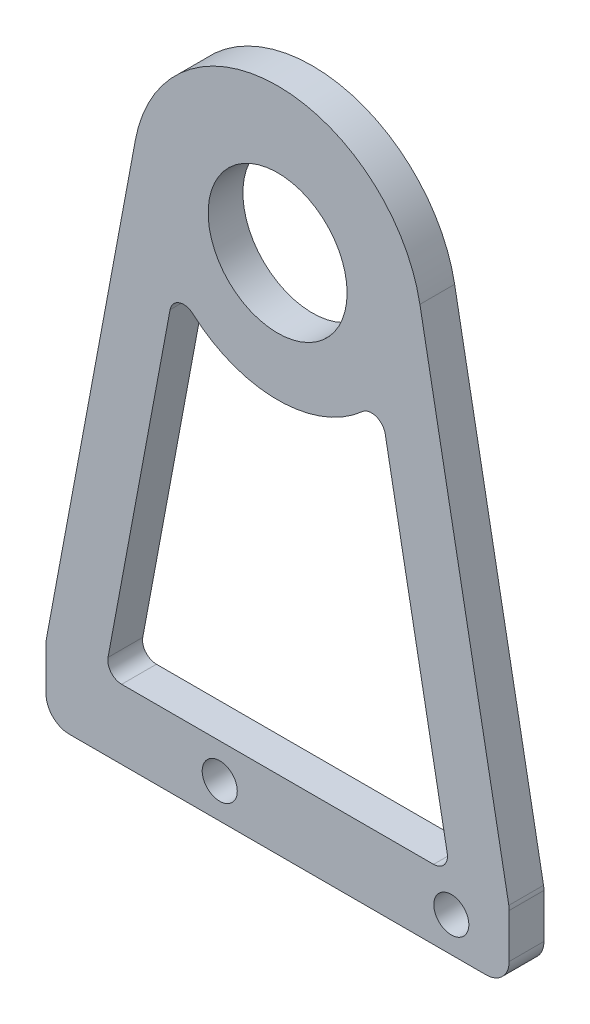
ISO-10303-21;
HEADER;
FILE_DESCRIPTION(('STEP AP214'),'2;1');
FILE_NAME('part.step','',(''),(''),'','','');
FILE_SCHEMA(('AUTOMOTIVE_DESIGN { 1 0 10303 214 1 1 1 1 }'));
ENDSEC;
DATA;
#1=APPLICATION_CONTEXT('core data for automotive mechanical design processes');
#2=APPLICATION_PROTOCOL_DEFINITION('international standard','automotive_design',2000,#1);
#3=PRODUCT_CONTEXT('',#1,'mechanical');
#4=PRODUCT('Part','Part','',(#3));
#5=PRODUCT_RELATED_PRODUCT_CATEGORY('part','',(#4));
#6=PRODUCT_DEFINITION_FORMATION('','',#4);
#7=PRODUCT_DEFINITION_CONTEXT('part definition',#1,'design');
#8=PRODUCT_DEFINITION('design','',#6,#7);
#9=PRODUCT_DEFINITION_SHAPE('','',#8);
#10=(LENGTH_UNIT() NAMED_UNIT(*) SI_UNIT(.MILLI.,.METRE.));
#11=(NAMED_UNIT(*) PLANE_ANGLE_UNIT() SI_UNIT($,.RADIAN.));
#12=(NAMED_UNIT(*) SI_UNIT($,.STERADIAN.) SOLID_ANGLE_UNIT());
#13=UNCERTAINTY_MEASURE_WITH_UNIT(LENGTH_MEASURE(1.E-05),#10,'distance_accuracy_value','');
#14=(GEOMETRIC_REPRESENTATION_CONTEXT(3) GLOBAL_UNCERTAINTY_ASSIGNED_CONTEXT((#13)) GLOBAL_UNIT_ASSIGNED_CONTEXT((#10,
#11,#12)) REPRESENTATION_CONTEXT('',''));
#15=CARTESIAN_POINT('',(0.,0.,0.));
#16=DIRECTION('',(0.,0.,1.));
#17=DIRECTION('',(1.,0.,0.));
#18=AXIS2_PLACEMENT_3D('',#15,#16,#17);
#19=CARTESIAN_POINT('',(0.,0.,3.));
#20=DIRECTION('',(0.,0.,1.));
#21=DIRECTION('',(1.,0.,0.));
#22=AXIS2_PLACEMENT_3D('',#19,#20,#21);
#23=PLANE('',#22);
#24=CARTESIAN_POINT('',(0.,0.,3.));
#25=DIRECTION('',(0.,0.,-1.));
#26=DIRECTION('',(1.,0.,0.));
#27=AXIS2_PLACEMENT_3D('',#24,#25,#26);
#28=CIRCLE('',#27,11.);
#29=CARTESIAN_POINT('',(7.31318140539449,-8.21689586959652,3.));
#30=VERTEX_POINT('',#29);
#31=CARTESIAN_POINT('',(-7.31318140539449,-8.21689586959652,3.));
#32=VERTEX_POINT('',#31);
#33=EDGE_CURVE('E279',#30,#32,#28,.T.);
#34=ORIENTED_EDGE('',*,*,#33,.F.);
#35=CARTESIAN_POINT('',(8.11098301325571,-9.11328450991614,3.));
#36=DIRECTION('',(0.,0.,1.));
#37=DIRECTION('',(1.,0.,0.));
#38=AXIS2_PLACEMENT_3D('',#35,#36,#37);
#39=CIRCLE('',#38,1.2);
#40=CARTESIAN_POINT('',(9.2905862473719,-8.89297515908732,3.));
#41=VERTEX_POINT('',#40);
#42=EDGE_CURVE('E267',#30,#41,#39,.F.);
#43=ORIENTED_EDGE('',*,*,#42,.T.);
#44=DIRECTION('',(-0.183591125690682,0.983002695096828,0.));
#45=VECTOR('',#44,1.);
#46=CARTESIAN_POINT('',(14.9135439557391,-39.,3.));
#47=LINE('',#46,#45);
#48=CARTESIAN_POINT('',(14.6482789734066,-37.5796906491712,3.));
#49=VERTEX_POINT('',#48);
#50=EDGE_CURVE('E304',#49,#41,#47,.T.);
#51=ORIENTED_EDGE('',*,*,#50,.F.);
#52=CARTESIAN_POINT('',(13.4686757392904,-37.8,3.));
#53=DIRECTION('',(0.,0.,1.));
#54=DIRECTION('',(1.,0.,0.));
#55=AXIS2_PLACEMENT_3D('',#52,#53,#54);
#56=CIRCLE('',#55,1.2);
#57=CARTESIAN_POINT('',(13.4686757392904,-39.,3.));
#58=VERTEX_POINT('',#57);
#59=EDGE_CURVE('E263',#49,#58,#56,.F.);
#60=ORIENTED_EDGE('',*,*,#59,.T.);
#61=DIRECTION('',(1.,0.,0.));
#62=VECTOR('',#61,1.);
#63=CARTESIAN_POINT('',(-14.9135439557391,-39.,3.));
#64=LINE('',#63,#62);
#65=CARTESIAN_POINT('',(-13.4686757392904,-39.,3.));
#66=VERTEX_POINT('',#65);
#67=EDGE_CURVE('E301',#66,#58,#64,.T.);
#68=ORIENTED_EDGE('',*,*,#67,.F.);
#69=CARTESIAN_POINT('',(-13.4686757392904,-37.8,3.));
#70=DIRECTION('',(0.,0.,1.));
#71=DIRECTION('',(1.,0.,0.));
#72=AXIS2_PLACEMENT_3D('',#69,#70,#71);
#73=CIRCLE('',#72,1.2);
#74=CARTESIAN_POINT('',(-14.6482789734066,-37.5796906491712,3.));
#75=VERTEX_POINT('',#74);
#76=EDGE_CURVE('E271',#66,#75,#73,.F.);
#77=ORIENTED_EDGE('',*,*,#76,.T.);
#78=DIRECTION('',(-0.183591125690682,-0.983002695096828,0.));
#79=VECTOR('',#78,1.);
#80=CARTESIAN_POINT('',(-8.8498299870198,-6.5330321597896,3.));
#81=LINE('',#80,#79);
#82=CARTESIAN_POINT('',(-9.2905862473719,-8.89297515908732,3.));
#83=VERTEX_POINT('',#82);
#84=EDGE_CURVE('E280',#83,#75,#81,.T.);
#85=ORIENTED_EDGE('',*,*,#84,.F.);
#86=CARTESIAN_POINT('',(-8.11098301325571,-9.11328450991614,3.));
#87=DIRECTION('',(0.,0.,1.));
#88=DIRECTION('',(1.,0.,0.));
#89=AXIS2_PLACEMENT_3D('',#86,#87,#88);
#90=CIRCLE('',#89,1.2);
#91=EDGE_CURVE('E42',#83,#32,#90,.F.);
#92=ORIENTED_EDGE('',*,*,#91,.T.);
#93=EDGE_LOOP('',(#34,#43,#51,#60,#68,#77,#85,#92));
#94=FACE_BOUND('',#93,.T.);
#95=CARTESIAN_POINT('',(-4.99999999999999,-42.,3.));
#96=DIRECTION('',(0.,0.,1.));
#97=DIRECTION('',(1.,0.,0.));
#98=AXIS2_PLACEMENT_3D('',#95,#96,#97);
#99=CIRCLE('',#98,1.515);
#100=CARTESIAN_POINT('',(-3.48499999999999,-42.,3.));
#101=VERTEX_POINT('',#100);
#102=EDGE_CURVE('E231',#101,#101,#99,.T.);
#103=ORIENTED_EDGE('',*,*,#102,.F.);
#104=EDGE_LOOP('',(#103));
#105=FACE_BOUND('',#104,.T.);
#106=CARTESIAN_POINT('',(15.,-42.,3.));
#107=DIRECTION('',(0.,0.,1.));
#108=DIRECTION('',(1.,0.,0.));
#109=AXIS2_PLACEMENT_3D('',#106,#107,#108);
#110=CIRCLE('',#109,1.515);
#111=CARTESIAN_POINT('',(16.515,-42.,3.));
#112=VERTEX_POINT('',#111);
#113=EDGE_CURVE('E307',#112,#112,#110,.T.);
#114=ORIENTED_EDGE('',*,*,#113,.F.);
#115=EDGE_LOOP('',(#114));
#116=FACE_BOUND('',#115,.T.);
#117=DIRECTION('',(0.,-1.,0.));
#118=VECTOR('',#117,1.);
#119=CARTESIAN_POINT('',(-20.,-45.,3.));
#120=LINE('',#119,#118);
#121=CARTESIAN_POINT('',(-20.,-39.1851647767747,3.));
#122=VERTEX_POINT('',#121);
#123=CARTESIAN_POINT('',(-20.,-43.,3.));
#124=VERTEX_POINT('',#123);
#125=EDGE_CURVE('E321',#122,#124,#120,.T.);
#126=ORIENTED_EDGE('',*,*,#125,.T.);
#127=CARTESIAN_POINT('',(-18.,-43.,3.));
#128=DIRECTION('',(0.,0.,1.));
#129=DIRECTION('',(1.,0.,0.));
#130=AXIS2_PLACEMENT_3D('',#127,#128,#129);
#131=CIRCLE('',#130,2.);
#132=CARTESIAN_POINT('',(-18.,-45.,3.));
#133=VERTEX_POINT('',#132);
#134=EDGE_CURVE('E215',#124,#133,#131,.T.);
#135=ORIENTED_EDGE('',*,*,#134,.T.);
#136=DIRECTION('',(1.,0.,0.));
#137=VECTOR('',#136,1.);
#138=CARTESIAN_POINT('',(-20.,-45.,3.));
#139=LINE('',#138,#137);
#140=CARTESIAN_POINT('',(18.,-45.,3.));
#141=VERTEX_POINT('',#140);
#142=EDGE_CURVE('E323',#133,#141,#139,.T.);
#143=ORIENTED_EDGE('',*,*,#142,.T.);
#144=CARTESIAN_POINT('',(18.,-43.,3.));
#145=DIRECTION('',(0.,0.,1.));
#146=DIRECTION('',(1.,0.,0.));
#147=AXIS2_PLACEMENT_3D('',#144,#145,#146);
#148=CIRCLE('',#147,2.);
#149=CARTESIAN_POINT('',(20.,-43.,3.));
#150=VERTEX_POINT('',#149);
#151=EDGE_CURVE('E210',#141,#150,#148,.T.);
#152=ORIENTED_EDGE('',*,*,#151,.T.);
#153=DIRECTION('',(0.,1.,0.));
#154=VECTOR('',#153,1.);
#155=CARTESIAN_POINT('',(20.,-45.,3.));
#156=LINE('',#155,#154);
#157=CARTESIAN_POINT('',(20.,-39.1851647767748,3.));
#158=VERTEX_POINT('',#157);
#159=EDGE_CURVE('E191',#150,#158,#156,.T.);
#160=ORIENTED_EDGE('',*,*,#159,.T.);
#161=CARTESIAN_POINT('',(18.,-39.1851647767748,3.));
#162=DIRECTION('',(0.,0.,1.));
#163=DIRECTION('',(1.,0.,0.));
#164=AXIS2_PLACEMENT_3D('',#161,#162,#163);
#165=CIRCLE('',#164,2.);
#166=CARTESIAN_POINT('',(19.9660053901937,-38.8179825253934,3.));
#167=VERTEX_POINT('',#166);
#168=EDGE_CURVE('E167',#158,#167,#165,.T.);
#169=ORIENTED_EDGE('',*,*,#168,.T.);
#170=DIRECTION('',(-0.183591125690682,0.983002695096828,0.));
#171=VECTOR('',#170,1.);
#172=CARTESIAN_POINT('',(20.,-39.,3.));
#173=LINE('',#172,#171);
#174=CARTESIAN_POINT('',(12.2875336887104,2.29488907113352,3.));
#175=VERTEX_POINT('',#174);
#176=EDGE_CURVE('E158',#167,#175,#173,.T.);
#177=ORIENTED_EDGE('',*,*,#176,.T.);
#178=CARTESIAN_POINT('',(0.,0.,3.));
#179=DIRECTION('',(0.,0.,1.));
#180=DIRECTION('',(1.,0.,0.));
#181=AXIS2_PLACEMENT_3D('',#178,#179,#180);
#182=CIRCLE('',#181,12.5);
#183=CARTESIAN_POINT('',(-12.2875336887104,2.29488907113351,3.));
#184=VERTEX_POINT('',#183);
#185=EDGE_CURVE('E163',#175,#184,#182,.T.);
#186=ORIENTED_EDGE('',*,*,#185,.T.);
#187=DIRECTION('',(-0.183591125690682,-0.983002695096828,0.));
#188=VECTOR('',#187,1.);
#189=CARTESIAN_POINT('',(-20.,-39.,3.));
#190=LINE('',#189,#188);
#191=CARTESIAN_POINT('',(-19.9660053901937,-38.8179825253934,3.));
#192=VERTEX_POINT('',#191);
#193=EDGE_CURVE('E181',#184,#192,#190,.T.);
#194=ORIENTED_EDGE('',*,*,#193,.T.);
#195=CARTESIAN_POINT('',(-18.,-39.1851647767747,3.));
#196=DIRECTION('',(0.,0.,1.));
#197=DIRECTION('',(1.,0.,0.));
#198=AXIS2_PLACEMENT_3D('',#195,#196,#197);
#199=CIRCLE('',#198,2.);
#200=EDGE_CURVE('E213',#192,#122,#199,.T.);
#201=ORIENTED_EDGE('',*,*,#200,.T.);
#202=EDGE_LOOP('',(#126,#135,#143,#152,#160,#169,#177,#186,#194,#201));
#203=FACE_BOUND('',#202,.T.);
#204=CARTESIAN_POINT('',(0.,0.,3.));
#205=DIRECTION('',(0.,0.,1.));
#206=DIRECTION('',(1.,0.,0.));
#207=AXIS2_PLACEMENT_3D('',#204,#205,#206);
#208=CIRCLE('',#207,6.);
#209=CARTESIAN_POINT('',(6.,0.,3.));
#210=VERTEX_POINT('',#209);
#211=EDGE_CURVE('E315',#210,#210,#208,.T.);
#212=ORIENTED_EDGE('',*,*,#211,.F.);
#213=EDGE_LOOP('',(#212));
#214=FACE_BOUND('',#213,.T.);
#215=ADVANCED_FACE('F34',(#94,#105,#116,#203,#214),#23,.T.);
#216=CARTESIAN_POINT('',(0.,0.,0.));
#217=DIRECTION('',(0.,0.,1.));
#218=DIRECTION('',(1.,0.,0.));
#219=AXIS2_PLACEMENT_3D('',#216,#217,#218);
#220=PLANE('',#219);
#221=DIRECTION('',(1.,0.,0.));
#222=VECTOR('',#221,1.);
#223=CARTESIAN_POINT('',(0.,-39.,0.));
#224=LINE('',#223,#222);
#225=CARTESIAN_POINT('',(-13.4686757392904,-39.,0.));
#226=VERTEX_POINT('',#225);
#227=CARTESIAN_POINT('',(13.4686757392904,-39.,0.));
#228=VERTEX_POINT('',#227);
#229=EDGE_CURVE('E236',#226,#228,#224,.T.);
#230=ORIENTED_EDGE('',*,*,#229,.T.);
#231=CARTESIAN_POINT('',(13.4686757392904,-37.8,0.));
#232=DIRECTION('',(0.,0.,1.));
#233=DIRECTION('',(1.,0.,0.));
#234=AXIS2_PLACEMENT_3D('',#231,#232,#233);
#235=CIRCLE('',#234,1.2);
#236=CARTESIAN_POINT('',(14.6482789734066,-37.5796906491712,0.));
#237=VERTEX_POINT('',#236);
#238=EDGE_CURVE('E265',#228,#237,#235,.T.);
#239=ORIENTED_EDGE('',*,*,#238,.T.);
#240=DIRECTION('',(-0.183591125690682,0.983002695096829,0.));
#241=VECTOR('',#240,1.);
#242=CARTESIAN_POINT('',(7.37252021322621,1.37693344268011,0.));
#243=LINE('',#242,#241);
#244=CARTESIAN_POINT('',(9.2905862473719,-8.89297515908733,0.));
#245=VERTEX_POINT('',#244);
#246=EDGE_CURVE('E239',#237,#245,#243,.T.);
#247=ORIENTED_EDGE('',*,*,#246,.T.);
#248=CARTESIAN_POINT('',(8.11098301325571,-9.11328450991614,0.));
#249=DIRECTION('',(0.,0.,1.));
#250=DIRECTION('',(1.,0.,0.));
#251=AXIS2_PLACEMENT_3D('',#248,#249,#250);
#252=CIRCLE('',#251,1.2);
#253=CARTESIAN_POINT('',(7.31318140539449,-8.21689586959652,0.));
#254=VERTEX_POINT('',#253);
#255=EDGE_CURVE('E269',#245,#254,#252,.T.);
#256=ORIENTED_EDGE('',*,*,#255,.T.);
#257=CARTESIAN_POINT('',(0.,0.,0.));
#258=DIRECTION('',(0.,0.,1.));
#259=DIRECTION('',(1.,0.,0.));
#260=AXIS2_PLACEMENT_3D('',#257,#258,#259);
#261=CIRCLE('',#260,11.);
#262=CARTESIAN_POINT('',(-7.31318140539449,-8.21689586959652,0.));
#263=VERTEX_POINT('',#262);
#264=EDGE_CURVE('E242',#254,#263,#261,.F.);
#265=ORIENTED_EDGE('',*,*,#264,.T.);
#266=CARTESIAN_POINT('',(-8.11098301325571,-9.11328450991614,0.));
#267=DIRECTION('',(0.,0.,1.));
#268=DIRECTION('',(1.,0.,0.));
#269=AXIS2_PLACEMENT_3D('',#266,#267,#268);
#270=CIRCLE('',#269,1.2);
#271=CARTESIAN_POINT('',(-9.2905862473719,-8.89297515908732,0.));
#272=VERTEX_POINT('',#271);
#273=EDGE_CURVE('E11',#263,#272,#270,.T.);
#274=ORIENTED_EDGE('',*,*,#273,.T.);
#275=DIRECTION('',(-0.183591125690682,-0.983002695096829,0.));
#276=VECTOR('',#275,1.);
#277=CARTESIAN_POINT('',(-7.37252021322621,1.37693344268011,0.));
#278=LINE('',#277,#276);
#279=CARTESIAN_POINT('',(-14.6482789734066,-37.5796906491712,0.));
#280=VERTEX_POINT('',#279);
#281=EDGE_CURVE('E226',#272,#280,#278,.T.);
#282=ORIENTED_EDGE('',*,*,#281,.T.);
#283=CARTESIAN_POINT('',(-13.4686757392904,-37.8,0.));
#284=DIRECTION('',(0.,0.,1.));
#285=DIRECTION('',(1.,0.,0.));
#286=AXIS2_PLACEMENT_3D('',#283,#284,#285);
#287=CIRCLE('',#286,1.2);
#288=EDGE_CURVE('E273',#280,#226,#287,.T.);
#289=ORIENTED_EDGE('',*,*,#288,.T.);
#290=EDGE_LOOP('',(#230,#239,#247,#256,#265,#274,#282,#289));
#291=FACE_BOUND('',#290,.T.);
#292=CARTESIAN_POINT('',(-4.99999999999999,-42.,0.));
#293=DIRECTION('',(0.,0.,1.));
#294=DIRECTION('',(1.,0.,0.));
#295=AXIS2_PLACEMENT_3D('',#292,#293,#294);
#296=CIRCLE('',#295,1.515);
#297=CARTESIAN_POINT('',(-3.48499999999999,-42.,0.));
#298=VERTEX_POINT('',#297);
#299=EDGE_CURVE('E230',#298,#298,#296,.T.);
#300=ORIENTED_EDGE('',*,*,#299,.T.);
#301=EDGE_LOOP('',(#300));
#302=FACE_BOUND('',#301,.T.);
#303=CARTESIAN_POINT('',(15.,-42.,0.));
#304=DIRECTION('',(0.,0.,1.));
#305=DIRECTION('',(1.,0.,0.));
#306=AXIS2_PLACEMENT_3D('',#303,#304,#305);
#307=CIRCLE('',#306,1.515);
#308=CARTESIAN_POINT('',(16.515,-42.,0.));
#309=VERTEX_POINT('',#308);
#310=EDGE_CURVE('E227',#309,#309,#307,.T.);
#311=ORIENTED_EDGE('',*,*,#310,.T.);
#312=EDGE_LOOP('',(#311));
#313=FACE_BOUND('',#312,.T.);
#314=DIRECTION('',(1.,0.,0.));
#315=VECTOR('',#314,1.);
#316=CARTESIAN_POINT('',(-20.,-45.,0.));
#317=LINE('',#316,#315);
#318=CARTESIAN_POINT('',(-18.,-45.,0.));
#319=VERTEX_POINT('',#318);
#320=CARTESIAN_POINT('',(18.,-45.,0.));
#321=VERTEX_POINT('',#320);
#322=EDGE_CURVE('E336',#319,#321,#317,.T.);
#323=ORIENTED_EDGE('',*,*,#322,.F.);
#324=CARTESIAN_POINT('',(-18.,-43.,0.));
#325=DIRECTION('',(0.,0.,1.));
#326=DIRECTION('',(1.,0.,0.));
#327=AXIS2_PLACEMENT_3D('',#324,#325,#326);
#328=CIRCLE('',#327,2.);
#329=CARTESIAN_POINT('',(-20.,-43.,0.));
#330=VERTEX_POINT('',#329);
#331=EDGE_CURVE('E203',#319,#330,#328,.F.);
#332=ORIENTED_EDGE('',*,*,#331,.T.);
#333=DIRECTION('',(0.,-1.,0.));
#334=VECTOR('',#333,1.);
#335=CARTESIAN_POINT('',(-20.,-45.,0.));
#336=LINE('',#335,#334);
#337=CARTESIAN_POINT('',(-20.,-39.1851647767747,0.));
#338=VERTEX_POINT('',#337);
#339=EDGE_CURVE('E333',#338,#330,#336,.T.);
#340=ORIENTED_EDGE('',*,*,#339,.F.);
#341=CARTESIAN_POINT('',(-18.,-39.1851647767747,0.));
#342=DIRECTION('',(0.,0.,1.));
#343=DIRECTION('',(1.,0.,0.));
#344=AXIS2_PLACEMENT_3D('',#341,#342,#343);
#345=CIRCLE('',#344,2.);
#346=CARTESIAN_POINT('',(-19.9660053901937,-38.8179825253934,0.));
#347=VERTEX_POINT('',#346);
#348=EDGE_CURVE('E201',#338,#347,#345,.F.);
#349=ORIENTED_EDGE('',*,*,#348,.T.);
#350=DIRECTION('',(-0.183591125690682,-0.983002695096828,0.));
#351=VECTOR('',#350,1.);
#352=CARTESIAN_POINT('',(-20.,-39.,0.));
#353=LINE('',#352,#351);
#354=CARTESIAN_POINT('',(-12.2875336887104,2.29488907113351,0.));
#355=VERTEX_POINT('',#354);
#356=EDGE_CURVE('E330',#355,#347,#353,.T.);
#357=ORIENTED_EDGE('',*,*,#356,.F.);
#358=CARTESIAN_POINT('',(0.,0.,0.));
#359=DIRECTION('',(0.,0.,1.));
#360=DIRECTION('',(1.,0.,0.));
#361=AXIS2_PLACEMENT_3D('',#358,#359,#360);
#362=CIRCLE('',#361,12.5);
#363=CARTESIAN_POINT('',(12.2875336887104,2.29488907113352,0.));
#364=VERTEX_POINT('',#363);
#365=EDGE_CURVE('E328',#364,#355,#362,.T.);
#366=ORIENTED_EDGE('',*,*,#365,.F.);
#367=DIRECTION('',(-0.183591125690682,0.983002695096828,0.));
#368=VECTOR('',#367,1.);
#369=CARTESIAN_POINT('',(20.,-39.,0.));
#370=LINE('',#369,#368);
#371=CARTESIAN_POINT('',(19.9660053901937,-38.8179825253934,0.));
#372=VERTEX_POINT('',#371);
#373=EDGE_CURVE('E185',#372,#364,#370,.T.);
#374=ORIENTED_EDGE('',*,*,#373,.F.);
#375=CARTESIAN_POINT('',(18.,-39.1851647767748,0.));
#376=DIRECTION('',(0.,0.,1.));
#377=DIRECTION('',(1.,0.,0.));
#378=AXIS2_PLACEMENT_3D('',#375,#376,#377);
#379=CIRCLE('',#378,2.);
#380=CARTESIAN_POINT('',(20.,-39.1851647767748,0.));
#381=VERTEX_POINT('',#380);
#382=EDGE_CURVE('E199',#372,#381,#379,.F.);
#383=ORIENTED_EDGE('',*,*,#382,.T.);
#384=DIRECTION('',(0.,1.,0.));
#385=VECTOR('',#384,1.);
#386=CARTESIAN_POINT('',(20.,-45.,0.));
#387=LINE('',#386,#385);
#388=CARTESIAN_POINT('',(20.,-43.,0.));
#389=VERTEX_POINT('',#388);
#390=EDGE_CURVE('E172',#389,#381,#387,.T.);
#391=ORIENTED_EDGE('',*,*,#390,.F.);
#392=CARTESIAN_POINT('',(18.,-43.,0.));
#393=DIRECTION('',(0.,0.,1.));
#394=DIRECTION('',(1.,0.,0.));
#395=AXIS2_PLACEMENT_3D('',#392,#393,#394);
#396=CIRCLE('',#395,2.);
#397=EDGE_CURVE('E197',#389,#321,#396,.F.);
#398=ORIENTED_EDGE('',*,*,#397,.T.);
#399=EDGE_LOOP('',(#323,#332,#340,#349,#357,#366,#374,#383,#391,#398));
#400=FACE_BOUND('',#399,.T.);
#401=CARTESIAN_POINT('',(0.,0.,0.));
#402=DIRECTION('',(0.,0.,1.));
#403=DIRECTION('',(1.,0.,0.));
#404=AXIS2_PLACEMENT_3D('',#401,#402,#403);
#405=CIRCLE('',#404,6.);
#406=CARTESIAN_POINT('',(6.,0.,0.));
#407=VERTEX_POINT('',#406);
#408=EDGE_CURVE('E234',#407,#407,#405,.T.);
#409=ORIENTED_EDGE('',*,*,#408,.T.);
#410=EDGE_LOOP('',(#409));
#411=FACE_BOUND('',#410,.T.);
#412=ADVANCED_FACE('F291',(#291,#302,#313,#400,#411),#220,.F.);
#413=CARTESIAN_POINT('',(20.,-39.,3.));
#414=DIRECTION('',(-0.983002695096828,-0.183591125690682,0.));
#415=DIRECTION('',(0.183591125690682,-0.983002695096829,0.));
#416=AXIS2_PLACEMENT_3D('',#413,#414,#415);
#417=PLANE('',#416);
#418=ORIENTED_EDGE('',*,*,#176,.F.);
#419=DIRECTION('',(0.,0.,-1.));
#420=VECTOR('',#419,1.);
#421=CARTESIAN_POINT('',(19.9660053901937,-38.8179825253934,3.));
#422=LINE('',#421,#420);
#423=EDGE_CURVE('E219',#167,#372,#422,.T.);
#424=ORIENTED_EDGE('',*,*,#423,.T.);
#425=ORIENTED_EDGE('',*,*,#373,.T.);
#426=DIRECTION('',(0.,0.,-1.));
#427=VECTOR('',#426,1.);
#428=CARTESIAN_POINT('',(12.2875336887104,2.29488907113352,3.));
#429=LINE('',#428,#427);
#430=EDGE_CURVE('E177',#175,#364,#429,.T.);
#431=ORIENTED_EDGE('',*,*,#430,.F.);
#432=EDGE_LOOP('',(#418,#424,#425,#431));
#433=FACE_BOUND('',#432,.T.);
#434=ADVANCED_FACE('F183',(#433),#417,.F.);
#435=CARTESIAN_POINT('',(0.,0.,3.));
#436=DIRECTION('',(0.,0.,-1.));
#437=DIRECTION('',(-1.,0.,0.));
#438=AXIS2_PLACEMENT_3D('',#435,#436,#437);
#439=CYLINDRICAL_SURFACE('',#438,12.5);
#440=ORIENTED_EDGE('',*,*,#365,.T.);
#441=DIRECTION('',(0.,0.,-1.));
#442=VECTOR('',#441,1.);
#443=CARTESIAN_POINT('',(-12.2875336887104,2.29488907113351,3.));
#444=LINE('',#443,#442);
#445=EDGE_CURVE('E179',#184,#355,#444,.T.);
#446=ORIENTED_EDGE('',*,*,#445,.F.);
#447=ORIENTED_EDGE('',*,*,#185,.F.);
#448=ORIENTED_EDGE('',*,*,#430,.T.);
#449=EDGE_LOOP('',(#440,#446,#447,#448));
#450=FACE_BOUND('',#449,.T.);
#451=ADVANCED_FACE('F176',(#450),#439,.T.);
#452=CARTESIAN_POINT('',(-20.,-39.,3.));
#453=DIRECTION('',(0.983002695096828,-0.183591125690682,0.));
#454=DIRECTION('',(0.183591125690682,0.983002695096829,0.));
#455=AXIS2_PLACEMENT_3D('',#452,#453,#454);
#456=PLANE('',#455);
#457=ORIENTED_EDGE('',*,*,#356,.T.);
#458=DIRECTION('',(0.,0.,-1.));
#459=VECTOR('',#458,1.);
#460=CARTESIAN_POINT('',(-19.9660053901937,-38.8179825253934,3.));
#461=LINE('',#460,#459);
#462=EDGE_CURVE('E217',#347,#192,#461,.F.);
#463=ORIENTED_EDGE('',*,*,#462,.T.);
#464=ORIENTED_EDGE('',*,*,#193,.F.);
#465=ORIENTED_EDGE('',*,*,#445,.T.);
#466=EDGE_LOOP('',(#457,#463,#464,#465));
#467=FACE_BOUND('',#466,.T.);
#468=ADVANCED_FACE('F352',(#467),#456,.F.);
#469=CARTESIAN_POINT('',(-20.,-45.,3.));
#470=DIRECTION('',(1.,0.,0.));
#471=DIRECTION('',(0.,1.,0.));
#472=AXIS2_PLACEMENT_3D('',#469,#470,#471);
#473=PLANE('',#472);
#474=ORIENTED_EDGE('',*,*,#339,.T.);
#475=DIRECTION('',(0.,0.,-1.));
#476=VECTOR('',#475,1.);
#477=CARTESIAN_POINT('',(-20.,-43.,3.));
#478=LINE('',#477,#476);
#479=EDGE_CURVE('E208',#330,#124,#478,.F.);
#480=ORIENTED_EDGE('',*,*,#479,.T.);
#481=ORIENTED_EDGE('',*,*,#125,.F.);
#482=DIRECTION('',(0.,0.,-1.));
#483=VECTOR('',#482,1.);
#484=CARTESIAN_POINT('',(-20.,-39.1851647767747,3.));
#485=LINE('',#484,#483);
#486=EDGE_CURVE('E205',#122,#338,#485,.T.);
#487=ORIENTED_EDGE('',*,*,#486,.T.);
#488=EDGE_LOOP('',(#474,#480,#481,#487));
#489=FACE_BOUND('',#488,.T.);
#490=ADVANCED_FACE('F361',(#489),#473,.F.);
#491=CARTESIAN_POINT('',(-20.,-45.,3.));
#492=DIRECTION('',(0.,1.,0.));
#493=DIRECTION('',(-1.,0.,0.));
#494=AXIS2_PLACEMENT_3D('',#491,#492,#493);
#495=PLANE('',#494);
#496=ORIENTED_EDGE('',*,*,#142,.F.);
#497=DIRECTION('',(0.,0.,-1.));
#498=VECTOR('',#497,1.);
#499=CARTESIAN_POINT('',(-18.,-45.,3.));
#500=LINE('',#499,#498);
#501=EDGE_CURVE('E189',#133,#319,#500,.T.);
#502=ORIENTED_EDGE('',*,*,#501,.T.);
#503=ORIENTED_EDGE('',*,*,#322,.T.);
#504=DIRECTION('',(0.,0.,-1.));
#505=VECTOR('',#504,1.);
#506=CARTESIAN_POINT('',(18.,-45.,3.));
#507=LINE('',#506,#505);
#508=EDGE_CURVE('E187',#321,#141,#507,.F.);
#509=ORIENTED_EDGE('',*,*,#508,.T.);
#510=EDGE_LOOP('',(#496,#502,#503,#509));
#511=FACE_BOUND('',#510,.T.);
#512=ADVANCED_FACE('F369',(#511),#495,.F.);
#513=CARTESIAN_POINT('',(20.,-45.,3.));
#514=DIRECTION('',(-1.,0.,0.));
#515=DIRECTION('',(0.,0.,1.));
#516=AXIS2_PLACEMENT_3D('',#513,#514,#515);
#517=PLANE('',#516);
#518=ORIENTED_EDGE('',*,*,#390,.T.);
#519=DIRECTION('',(0.,0.,-1.));
#520=VECTOR('',#519,1.);
#521=CARTESIAN_POINT('',(20.,-39.1851647767748,3.));
#522=LINE('',#521,#520);
#523=EDGE_CURVE('E224',#381,#158,#522,.F.);
#524=ORIENTED_EDGE('',*,*,#523,.T.);
#525=ORIENTED_EDGE('',*,*,#159,.F.);
#526=DIRECTION('',(0.,0.,-1.));
#527=VECTOR('',#526,1.);
#528=CARTESIAN_POINT('',(20.,-43.,3.));
#529=LINE('',#528,#527);
#530=EDGE_CURVE('E221',#150,#389,#529,.T.);
#531=ORIENTED_EDGE('',*,*,#530,.T.);
#532=EDGE_LOOP('',(#518,#524,#525,#531));
#533=FACE_BOUND('',#532,.T.);
#534=ADVANCED_FACE('F342',(#533),#517,.F.);
#535=CARTESIAN_POINT('',(0.,0.,3.));
#536=DIRECTION('',(0.,0.,-1.));
#537=DIRECTION('',(-1.,0.,0.));
#538=AXIS2_PLACEMENT_3D('',#535,#536,#537);
#539=CYLINDRICAL_SURFACE('',#538,6.);
#540=ORIENTED_EDGE('',*,*,#211,.T.);
#541=EDGE_LOOP('',(#540));
#542=FACE_BOUND('',#541,.T.);
#543=ORIENTED_EDGE('',*,*,#408,.F.);
#544=EDGE_LOOP('',(#543));
#545=FACE_BOUND('',#544,.T.);
#546=ADVANCED_FACE('F393',(#542,#545),#539,.F.);
#547=CARTESIAN_POINT('',(-18.,-43.,3.));
#548=DIRECTION('',(0.,0.,-1.));
#549=DIRECTION('',(-1.,0.,0.));
#550=AXIS2_PLACEMENT_3D('',#547,#548,#549);
#551=CYLINDRICAL_SURFACE('',#550,2.);
#552=ORIENTED_EDGE('',*,*,#134,.F.);
#553=ORIENTED_EDGE('',*,*,#479,.F.);
#554=ORIENTED_EDGE('',*,*,#331,.F.);
#555=ORIENTED_EDGE('',*,*,#501,.F.);
#556=EDGE_LOOP('',(#552,#553,#554,#555));
#557=FACE_BOUND('',#556,.T.);
#558=ADVANCED_FACE('F366',(#557),#551,.T.);
#559=CARTESIAN_POINT('',(-18.,-39.1851647767747,3.));
#560=DIRECTION('',(0.,0.,-1.));
#561=DIRECTION('',(-1.,0.,0.));
#562=AXIS2_PLACEMENT_3D('',#559,#560,#561);
#563=CYLINDRICAL_SURFACE('',#562,2.);
#564=ORIENTED_EDGE('',*,*,#200,.F.);
#565=ORIENTED_EDGE('',*,*,#462,.F.);
#566=ORIENTED_EDGE('',*,*,#348,.F.);
#567=ORIENTED_EDGE('',*,*,#486,.F.);
#568=EDGE_LOOP('',(#564,#565,#566,#567));
#569=FACE_BOUND('',#568,.T.);
#570=ADVANCED_FACE('F358',(#569),#563,.T.);
#571=CARTESIAN_POINT('',(18.,-39.1851647767748,3.));
#572=DIRECTION('',(0.,0.,-1.));
#573=DIRECTION('',(-1.,0.,0.));
#574=AXIS2_PLACEMENT_3D('',#571,#572,#573);
#575=CYLINDRICAL_SURFACE('',#574,2.);
#576=ORIENTED_EDGE('',*,*,#168,.F.);
#577=ORIENTED_EDGE('',*,*,#523,.F.);
#578=ORIENTED_EDGE('',*,*,#382,.F.);
#579=ORIENTED_EDGE('',*,*,#423,.F.);
#580=EDGE_LOOP('',(#576,#577,#578,#579));
#581=FACE_BOUND('',#580,.T.);
#582=ADVANCED_FACE('F347',(#581),#575,.T.);
#583=CARTESIAN_POINT('',(18.,-43.,3.));
#584=DIRECTION('',(0.,0.,-1.));
#585=DIRECTION('',(-1.,0.,0.));
#586=AXIS2_PLACEMENT_3D('',#583,#584,#585);
#587=CYLINDRICAL_SURFACE('',#586,2.);
#588=ORIENTED_EDGE('',*,*,#151,.F.);
#589=ORIENTED_EDGE('',*,*,#508,.F.);
#590=ORIENTED_EDGE('',*,*,#397,.F.);
#591=ORIENTED_EDGE('',*,*,#530,.F.);
#592=EDGE_LOOP('',(#588,#589,#590,#591));
#593=FACE_BOUND('',#592,.T.);
#594=ADVANCED_FACE('F373',(#593),#587,.T.);
#595=CARTESIAN_POINT('',(15.,-42.,-7.));
#596=DIRECTION('',(0.,0.,1.));
#597=DIRECTION('',(1.,0.,0.));
#598=AXIS2_PLACEMENT_3D('',#595,#596,#597);
#599=CYLINDRICAL_SURFACE('',#598,1.515);
#600=ORIENTED_EDGE('',*,*,#113,.T.);
#601=EDGE_LOOP('',(#600));
#602=FACE_BOUND('',#601,.T.);
#603=ORIENTED_EDGE('',*,*,#310,.F.);
#604=EDGE_LOOP('',(#603));
#605=FACE_BOUND('',#604,.T.);
#606=ADVANCED_FACE('F375',(#602,#605),#599,.F.);
#607=CARTESIAN_POINT('',(-4.99999999999999,-42.,-7.));
#608=DIRECTION('',(0.,0.,1.));
#609=DIRECTION('',(1.,0.,0.));
#610=AXIS2_PLACEMENT_3D('',#607,#608,#609);
#611=CYLINDRICAL_SURFACE('',#610,1.515);
#612=ORIENTED_EDGE('',*,*,#102,.T.);
#613=EDGE_LOOP('',(#612));
#614=FACE_BOUND('',#613,.T.);
#615=ORIENTED_EDGE('',*,*,#299,.F.);
#616=EDGE_LOOP('',(#615));
#617=FACE_BOUND('',#616,.T.);
#618=ADVANCED_FACE('F381',(#614,#617),#611,.F.);
#619=CARTESIAN_POINT('',(0.,0.,-7.));
#620=DIRECTION('',(0.,0.,1.));
#621=DIRECTION('',(1.,0.,0.));
#622=AXIS2_PLACEMENT_3D('',#619,#620,#621);
#623=CYLINDRICAL_SURFACE('',#622,11.);
#624=ORIENTED_EDGE('',*,*,#264,.F.);
#625=DIRECTION('',(0.,0.,1.));
#626=VECTOR('',#625,1.);
#627=CARTESIAN_POINT('',(7.31318140539449,-8.21689586959652,-7.));
#628=LINE('',#627,#626);
#629=EDGE_CURVE('E256',#254,#30,#628,.T.);
#630=ORIENTED_EDGE('',*,*,#629,.T.);
#631=ORIENTED_EDGE('',*,*,#33,.T.);
#632=DIRECTION('',(0.,0.,1.));
#633=VECTOR('',#632,1.);
#634=CARTESIAN_POINT('',(-7.31318140539449,-8.21689586959652,-7.));
#635=LINE('',#634,#633);
#636=EDGE_CURVE('E254',#32,#263,#635,.F.);
#637=ORIENTED_EDGE('',*,*,#636,.T.);
#638=EDGE_LOOP('',(#624,#630,#631,#637));
#639=FACE_BOUND('',#638,.T.);
#640=ADVANCED_FACE('F286',(#639),#623,.T.);
#641=CARTESIAN_POINT('',(14.9135439557391,-39.,-7.));
#642=DIRECTION('',(0.983002695096829,0.183591125690682,0.));
#643=DIRECTION('',(-0.183591125690682,0.983002695096829,0.));
#644=AXIS2_PLACEMENT_3D('',#641,#642,#643);
#645=PLANE('',#644);
#646=ORIENTED_EDGE('',*,*,#246,.F.);
#647=DIRECTION('',(0.,0.,1.));
#648=VECTOR('',#647,1.);
#649=CARTESIAN_POINT('',(14.6482789734066,-37.5796906491712,3.));
#650=LINE('',#649,#648);
#651=EDGE_CURVE('E246',#237,#49,#650,.T.);
#652=ORIENTED_EDGE('',*,*,#651,.T.);
#653=ORIENTED_EDGE('',*,*,#50,.T.);
#654=DIRECTION('',(0.,0.,-1.));
#655=VECTOR('',#654,1.);
#656=CARTESIAN_POINT('',(9.2905862473719,-8.89297515908732,0.));
#657=LINE('',#656,#655);
#658=EDGE_CURVE('E244',#41,#245,#657,.T.);
#659=ORIENTED_EDGE('',*,*,#658,.T.);
#660=EDGE_LOOP('',(#646,#652,#653,#659));
#661=FACE_BOUND('',#660,.T.);
#662=ADVANCED_FACE('F458',(#661),#645,.F.);
#663=CARTESIAN_POINT('',(-14.9135439557391,-39.,-7.));
#664=DIRECTION('',(0.,-1.,0.));
#665=DIRECTION('',(0.,0.,-1.));
#666=AXIS2_PLACEMENT_3D('',#663,#664,#665);
#667=PLANE('',#666);
#668=ORIENTED_EDGE('',*,*,#67,.T.);
#669=DIRECTION('',(0.,0.,1.));
#670=VECTOR('',#669,1.);
#671=CARTESIAN_POINT('',(13.4686757392904,-39.,0.));
#672=LINE('',#671,#670);
#673=EDGE_CURVE('E252',#58,#228,#672,.F.);
#674=ORIENTED_EDGE('',*,*,#673,.T.);
#675=ORIENTED_EDGE('',*,*,#229,.F.);
#676=DIRECTION('',(0.,0.,1.));
#677=VECTOR('',#676,1.);
#678=CARTESIAN_POINT('',(-13.4686757392904,-39.,3.));
#679=LINE('',#678,#677);
#680=EDGE_CURVE('E249',#226,#66,#679,.T.);
#681=ORIENTED_EDGE('',*,*,#680,.T.);
#682=EDGE_LOOP('',(#668,#674,#675,#681));
#683=FACE_BOUND('',#682,.T.);
#684=ADVANCED_FACE('F300',(#683),#667,.F.);
#685=CARTESIAN_POINT('',(-8.8498299870198,-6.5330321597896,-7.));
#686=DIRECTION('',(-0.983002695096829,0.183591125690682,0.));
#687=DIRECTION('',(-0.183591125690682,-0.983002695096829,0.));
#688=AXIS2_PLACEMENT_3D('',#685,#686,#687);
#689=PLANE('',#688);
#690=ORIENTED_EDGE('',*,*,#84,.T.);
#691=DIRECTION('',(0.,0.,1.));
#692=VECTOR('',#691,1.);
#693=CARTESIAN_POINT('',(-14.6482789734066,-37.5796906491712,0.));
#694=LINE('',#693,#692);
#695=EDGE_CURVE('E49',#75,#280,#694,.F.);
#696=ORIENTED_EDGE('',*,*,#695,.T.);
#697=ORIENTED_EDGE('',*,*,#281,.F.);
#698=DIRECTION('',(0.,0.,-1.));
#699=VECTOR('',#698,1.);
#700=CARTESIAN_POINT('',(-9.2905862473719,-8.89297515908732,3.));
#701=LINE('',#700,#699);
#702=EDGE_CURVE('E259',#272,#83,#701,.F.);
#703=ORIENTED_EDGE('',*,*,#702,.T.);
#704=EDGE_LOOP('',(#690,#696,#697,#703));
#705=FACE_BOUND('',#704,.T.);
#706=ADVANCED_FACE('F289',(#705),#689,.F.);
#707=CARTESIAN_POINT('',(13.4686757392904,-37.8,-7.));
#708=DIRECTION('',(0.,0.,-1.));
#709=DIRECTION('',(-1.,0.,0.));
#710=AXIS2_PLACEMENT_3D('',#707,#708,#709);
#711=CYLINDRICAL_SURFACE('',#710,1.2);
#712=ORIENTED_EDGE('',*,*,#238,.F.);
#713=ORIENTED_EDGE('',*,*,#673,.F.);
#714=ORIENTED_EDGE('',*,*,#59,.F.);
#715=ORIENTED_EDGE('',*,*,#651,.F.);
#716=EDGE_LOOP('',(#712,#713,#714,#715));
#717=FACE_BOUND('',#716,.T.);
#718=ADVANCED_FACE('F484',(#717),#711,.F.);
#719=CARTESIAN_POINT('',(8.11098301325571,-9.11328450991614,-7.));
#720=DIRECTION('',(0.,0.,1.));
#721=DIRECTION('',(1.,0.,0.));
#722=AXIS2_PLACEMENT_3D('',#719,#720,#721);
#723=CYLINDRICAL_SURFACE('',#722,1.2);
#724=ORIENTED_EDGE('',*,*,#255,.F.);
#725=ORIENTED_EDGE('',*,*,#658,.F.);
#726=ORIENTED_EDGE('',*,*,#42,.F.);
#727=ORIENTED_EDGE('',*,*,#629,.F.);
#728=EDGE_LOOP('',(#724,#725,#726,#727));
#729=FACE_BOUND('',#728,.T.);
#730=ADVANCED_FACE('F493',(#729),#723,.F.);
#731=CARTESIAN_POINT('',(-13.4686757392904,-37.8,-7.));
#732=DIRECTION('',(0.,0.,-1.));
#733=DIRECTION('',(-1.,0.,0.));
#734=AXIS2_PLACEMENT_3D('',#731,#732,#733);
#735=CYLINDRICAL_SURFACE('',#734,1.2);
#736=ORIENTED_EDGE('',*,*,#288,.F.);
#737=ORIENTED_EDGE('',*,*,#695,.F.);
#738=ORIENTED_EDGE('',*,*,#76,.F.);
#739=ORIENTED_EDGE('',*,*,#680,.F.);
#740=EDGE_LOOP('',(#736,#737,#738,#739));
#741=FACE_BOUND('',#740,.T.);
#742=ADVANCED_FACE('F296',(#741),#735,.F.);
#743=CARTESIAN_POINT('',(-8.11098301325571,-9.11328450991614,-7.));
#744=DIRECTION('',(0.,0.,1.));
#745=DIRECTION('',(1.,0.,0.));
#746=AXIS2_PLACEMENT_3D('',#743,#744,#745);
#747=CYLINDRICAL_SURFACE('',#746,1.2);
#748=ORIENTED_EDGE('',*,*,#273,.F.);
#749=ORIENTED_EDGE('',*,*,#636,.F.);
#750=ORIENTED_EDGE('',*,*,#91,.F.);
#751=ORIENTED_EDGE('',*,*,#702,.F.);
#752=EDGE_LOOP('',(#748,#749,#750,#751));
#753=FACE_BOUND('',#752,.T.);
#754=ADVANCED_FACE('F36',(#753),#747,.F.);
#755=CLOSED_SHELL('',(#215,#412,#434,#451,#468,#490,#512,#534,#546,#558,#570,#582,#594,#606,
#618,#640,#662,#684,#706,#718,#730,#742,#754));
#756=MANIFOLD_SOLID_BREP('B2',#755);
#757=ADVANCED_BREP_SHAPE_REPRESENTATION('',(#18,#756),#14);
#758=SHAPE_DEFINITION_REPRESENTATION(#9,#757);
ENDSEC;
END-ISO-10303-21;
